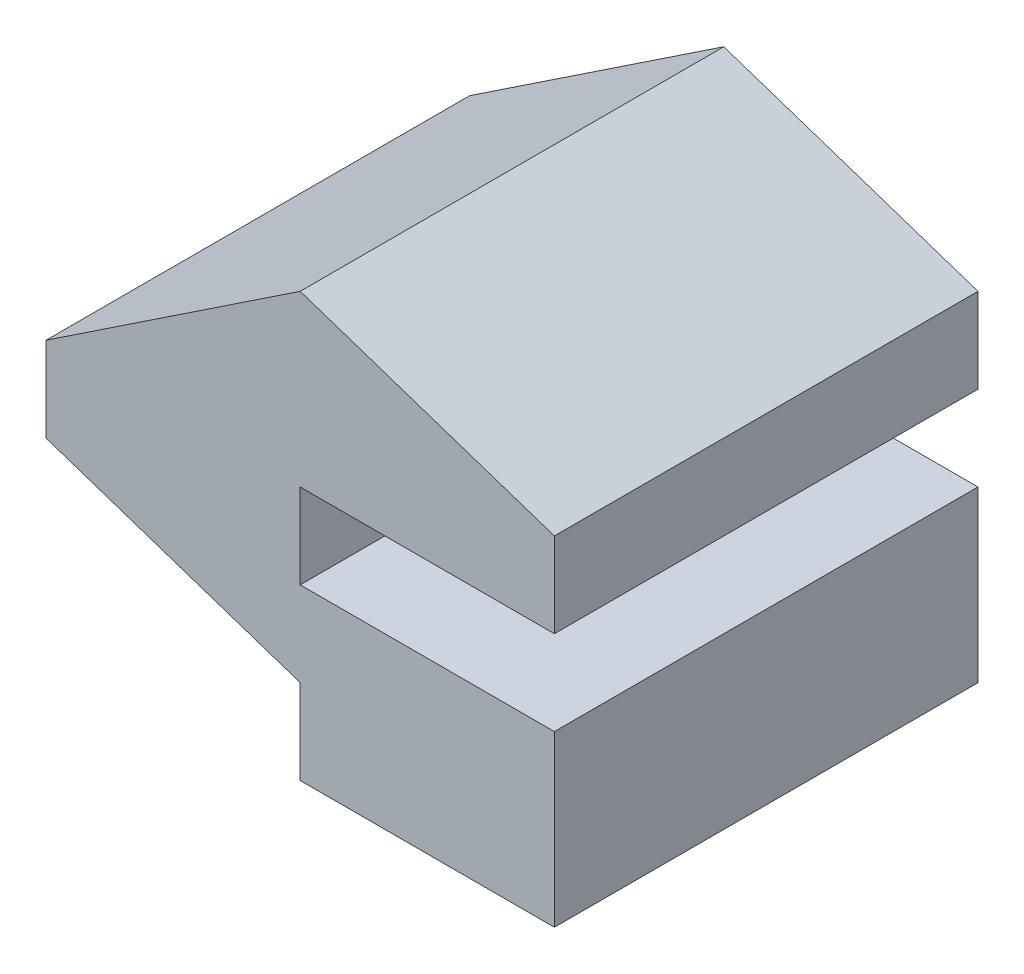
ISO-10303-21;
HEADER;
FILE_DESCRIPTION(('STEP AP214'),'2;1');
FILE_NAME('part.step','',(''),(''),'','','');
FILE_SCHEMA(('AUTOMOTIVE_DESIGN { 1 0 10303 214 1 1 1 1 }'));
ENDSEC;
DATA;
#1=APPLICATION_CONTEXT('core data for automotive mechanical design processes');
#2=APPLICATION_PROTOCOL_DEFINITION('international standard','automotive_design',2000,#1);
#3=PRODUCT_CONTEXT('',#1,'mechanical');
#4=PRODUCT('Part','Part','',(#3));
#5=PRODUCT_RELATED_PRODUCT_CATEGORY('part','',(#4));
#6=PRODUCT_DEFINITION_FORMATION('','',#4);
#7=PRODUCT_DEFINITION_CONTEXT('part definition',#1,'design');
#8=PRODUCT_DEFINITION('design','',#6,#7);
#9=PRODUCT_DEFINITION_SHAPE('','',#8);
#10=(LENGTH_UNIT() NAMED_UNIT(*) SI_UNIT(.MILLI.,.METRE.));
#11=(NAMED_UNIT(*) PLANE_ANGLE_UNIT() SI_UNIT($,.RADIAN.));
#12=(NAMED_UNIT(*) SI_UNIT($,.STERADIAN.) SOLID_ANGLE_UNIT());
#13=UNCERTAINTY_MEASURE_WITH_UNIT(LENGTH_MEASURE(1.E-05),#10,'distance_accuracy_value','');
#14=(GEOMETRIC_REPRESENTATION_CONTEXT(3) GLOBAL_UNCERTAINTY_ASSIGNED_CONTEXT((#13)) GLOBAL_UNIT_ASSIGNED_CONTEXT((#10,
#11,#12)) REPRESENTATION_CONTEXT('',''));
#15=CARTESIAN_POINT('',(0.,0.,0.));
#16=DIRECTION('',(0.,0.,1.));
#17=DIRECTION('',(1.,0.,0.));
#18=AXIS2_PLACEMENT_3D('',#15,#16,#17);
#19=CARTESIAN_POINT('',(3.,0.,5.));
#20=DIRECTION('',(0.,1.,0.));
#21=DIRECTION('',(-1.,0.,0.));
#22=AXIS2_PLACEMENT_3D('',#19,#20,#21);
#23=PLANE('',#22);
#24=DIRECTION('',(1.,0.,0.));
#25=VECTOR('',#24,1.);
#26=CARTESIAN_POINT('',(3.,0.,0.));
#27=LINE('',#26,#25);
#28=CARTESIAN_POINT('',(0.,0.,0.));
#29=VERTEX_POINT('',#28);
#30=CARTESIAN_POINT('',(3.,0.,0.));
#31=VERTEX_POINT('',#30);
#32=EDGE_CURVE('E147',#29,#31,#27,.T.);
#33=ORIENTED_EDGE('',*,*,#32,.T.);
#34=DIRECTION('',(0.,0.,-1.));
#35=VECTOR('',#34,1.);
#36=CARTESIAN_POINT('',(3.,0.,5.));
#37=LINE('',#36,#35);
#38=CARTESIAN_POINT('',(3.,0.,5.));
#39=VERTEX_POINT('',#38);
#40=EDGE_CURVE('E11',#39,#31,#37,.T.);
#41=ORIENTED_EDGE('',*,*,#40,.F.);
#42=DIRECTION('',(1.,0.,0.));
#43=VECTOR('',#42,1.);
#44=CARTESIAN_POINT('',(3.,0.,5.));
#45=LINE('',#44,#43);
#46=CARTESIAN_POINT('',(0.,0.,5.));
#47=VERTEX_POINT('',#46);
#48=EDGE_CURVE('E167',#47,#39,#45,.T.);
#49=ORIENTED_EDGE('',*,*,#48,.F.);
#50=DIRECTION('',(0.,0.,-1.));
#51=VECTOR('',#50,1.);
#52=CARTESIAN_POINT('',(0.,0.,5.));
#53=LINE('',#52,#51);
#54=EDGE_CURVE('E143',#47,#29,#53,.T.);
#55=ORIENTED_EDGE('',*,*,#54,.T.);
#56=EDGE_LOOP('',(#33,#41,#49,#55));
#57=FACE_BOUND('',#56,.T.);
#58=ADVANCED_FACE('F33',(#57),#23,.F.);
#59=CARTESIAN_POINT('',(3.,2.,5.));
#60=DIRECTION('',(-1.,0.,0.));
#61=DIRECTION('',(0.,-1.,0.));
#62=AXIS2_PLACEMENT_3D('',#59,#60,#61);
#63=PLANE('',#62);
#64=DIRECTION('',(0.,1.,0.));
#65=VECTOR('',#64,1.);
#66=CARTESIAN_POINT('',(3.,2.,0.));
#67=LINE('',#66,#65);
#68=CARTESIAN_POINT('',(3.,2.,0.));
#69=VERTEX_POINT('',#68);
#70=EDGE_CURVE('E150',#31,#69,#67,.T.);
#71=ORIENTED_EDGE('',*,*,#70,.T.);
#72=DIRECTION('',(0.,0.,-1.));
#73=VECTOR('',#72,1.);
#74=CARTESIAN_POINT('',(3.,2.,5.));
#75=LINE('',#74,#73);
#76=CARTESIAN_POINT('',(3.,2.,5.));
#77=VERTEX_POINT('',#76);
#78=EDGE_CURVE('E41',#77,#69,#75,.T.);
#79=ORIENTED_EDGE('',*,*,#78,.F.);
#80=DIRECTION('',(0.,1.,0.));
#81=VECTOR('',#80,1.);
#82=CARTESIAN_POINT('',(3.,2.,5.));
#83=LINE('',#82,#81);
#84=EDGE_CURVE('E101',#39,#77,#83,.T.);
#85=ORIENTED_EDGE('',*,*,#84,.F.);
#86=ORIENTED_EDGE('',*,*,#40,.T.);
#87=EDGE_LOOP('',(#71,#79,#85,#86));
#88=FACE_BOUND('',#87,.T.);
#89=ADVANCED_FACE('F239',(#88),#63,.F.);
#90=CARTESIAN_POINT('',(0.,2.,5.));
#91=DIRECTION('',(0.,-1.,0.));
#92=DIRECTION('',(1.,0.,0.));
#93=AXIS2_PLACEMENT_3D('',#90,#91,#92);
#94=PLANE('',#93);
#95=DIRECTION('',(-1.,0.,0.));
#96=VECTOR('',#95,1.);
#97=CARTESIAN_POINT('',(0.,2.,0.));
#98=LINE('',#97,#96);
#99=CARTESIAN_POINT('',(0.,2.,0.));
#100=VERTEX_POINT('',#99);
#101=EDGE_CURVE('E152',#69,#100,#98,.T.);
#102=ORIENTED_EDGE('',*,*,#101,.T.);
#103=DIRECTION('',(0.,0.,-1.));
#104=VECTOR('',#103,1.);
#105=CARTESIAN_POINT('',(0.,2.,5.));
#106=LINE('',#105,#104);
#107=CARTESIAN_POINT('',(0.,2.,5.));
#108=VERTEX_POINT('',#107);
#109=EDGE_CURVE('E183',#108,#100,#106,.T.);
#110=ORIENTED_EDGE('',*,*,#109,.F.);
#111=DIRECTION('',(-1.,0.,0.));
#112=VECTOR('',#111,1.);
#113=CARTESIAN_POINT('',(0.,2.,5.));
#114=LINE('',#113,#112);
#115=EDGE_CURVE('E191',#77,#108,#114,.T.);
#116=ORIENTED_EDGE('',*,*,#115,.F.);
#117=ORIENTED_EDGE('',*,*,#78,.T.);
#118=EDGE_LOOP('',(#102,#110,#116,#117));
#119=FACE_BOUND('',#118,.T.);
#120=ADVANCED_FACE('F189',(#119),#94,.F.);
#121=CARTESIAN_POINT('',(0.,3.,5.));
#122=DIRECTION('',(-1.,0.,0.));
#123=DIRECTION('',(0.,-1.,0.));
#124=AXIS2_PLACEMENT_3D('',#121,#122,#123);
#125=PLANE('',#124);
#126=DIRECTION('',(0.,1.,0.));
#127=VECTOR('',#126,1.);
#128=CARTESIAN_POINT('',(0.,3.,0.));
#129=LINE('',#128,#127);
#130=CARTESIAN_POINT('',(0.,3.,0.));
#131=VERTEX_POINT('',#130);
#132=EDGE_CURVE('E154',#100,#131,#129,.T.);
#133=ORIENTED_EDGE('',*,*,#132,.T.);
#134=DIRECTION('',(0.,0.,-1.));
#135=VECTOR('',#134,1.);
#136=CARTESIAN_POINT('',(0.,3.,5.));
#137=LINE('',#136,#135);
#138=CARTESIAN_POINT('',(0.,3.,5.));
#139=VERTEX_POINT('',#138);
#140=EDGE_CURVE('E180',#139,#131,#137,.T.);
#141=ORIENTED_EDGE('',*,*,#140,.F.);
#142=DIRECTION('',(0.,1.,0.));
#143=VECTOR('',#142,1.);
#144=CARTESIAN_POINT('',(0.,3.,5.));
#145=LINE('',#144,#143);
#146=EDGE_CURVE('E209',#108,#139,#145,.T.);
#147=ORIENTED_EDGE('',*,*,#146,.F.);
#148=ORIENTED_EDGE('',*,*,#109,.T.);
#149=EDGE_LOOP('',(#133,#141,#147,#148));
#150=FACE_BOUND('',#149,.T.);
#151=ADVANCED_FACE('F200',(#150),#125,.F.);
#152=CARTESIAN_POINT('',(3.,3.,5.));
#153=DIRECTION('',(0.,1.,0.));
#154=DIRECTION('',(-1.,0.,0.));
#155=AXIS2_PLACEMENT_3D('',#152,#153,#154);
#156=PLANE('',#155);
#157=DIRECTION('',(1.,0.,0.));
#158=VECTOR('',#157,1.);
#159=CARTESIAN_POINT('',(3.,3.,0.));
#160=LINE('',#159,#158);
#161=CARTESIAN_POINT('',(3.,3.,0.));
#162=VERTEX_POINT('',#161);
#163=EDGE_CURVE('E156',#131,#162,#160,.T.);
#164=ORIENTED_EDGE('',*,*,#163,.T.);
#165=DIRECTION('',(0.,0.,-1.));
#166=VECTOR('',#165,1.);
#167=CARTESIAN_POINT('',(3.,3.,5.));
#168=LINE('',#167,#166);
#169=CARTESIAN_POINT('',(3.,3.,5.));
#170=VERTEX_POINT('',#169);
#171=EDGE_CURVE('E177',#170,#162,#168,.T.);
#172=ORIENTED_EDGE('',*,*,#171,.F.);
#173=DIRECTION('',(1.,0.,0.));
#174=VECTOR('',#173,1.);
#175=CARTESIAN_POINT('',(3.,3.,5.));
#176=LINE('',#175,#174);
#177=EDGE_CURVE('E206',#139,#170,#176,.T.);
#178=ORIENTED_EDGE('',*,*,#177,.F.);
#179=ORIENTED_EDGE('',*,*,#140,.T.);
#180=EDGE_LOOP('',(#164,#172,#178,#179));
#181=FACE_BOUND('',#180,.T.);
#182=ADVANCED_FACE('F204',(#181),#156,.F.);
#183=CARTESIAN_POINT('',(3.,4.,5.));
#184=DIRECTION('',(-1.,0.,0.));
#185=DIRECTION('',(0.,0.,1.));
#186=AXIS2_PLACEMENT_3D('',#183,#184,#185);
#187=PLANE('',#186);
#188=DIRECTION('',(0.,1.,0.));
#189=VECTOR('',#188,1.);
#190=CARTESIAN_POINT('',(3.,4.,0.));
#191=LINE('',#190,#189);
#192=CARTESIAN_POINT('',(3.,4.,0.));
#193=VERTEX_POINT('',#192);
#194=EDGE_CURVE('E158',#162,#193,#191,.T.);
#195=ORIENTED_EDGE('',*,*,#194,.T.);
#196=DIRECTION('',(0.,0.,-1.));
#197=VECTOR('',#196,1.);
#198=CARTESIAN_POINT('',(3.,4.,5.));
#199=LINE('',#198,#197);
#200=CARTESIAN_POINT('',(3.,4.,5.));
#201=VERTEX_POINT('',#200);
#202=EDGE_CURVE('E174',#201,#193,#199,.T.);
#203=ORIENTED_EDGE('',*,*,#202,.F.);
#204=DIRECTION('',(0.,1.,0.));
#205=VECTOR('',#204,1.);
#206=CARTESIAN_POINT('',(3.,4.,5.));
#207=LINE('',#206,#205);
#208=EDGE_CURVE('E208',#170,#201,#207,.T.);
#209=ORIENTED_EDGE('',*,*,#208,.F.);
#210=ORIENTED_EDGE('',*,*,#171,.T.);
#211=EDGE_LOOP('',(#195,#203,#209,#210));
#212=FACE_BOUND('',#211,.T.);
#213=ADVANCED_FACE('F252',(#212),#187,.F.);
#214=CARTESIAN_POINT('',(0.,5.,5.));
#215=DIRECTION('',(-0.316227766016838,-0.948683298050514,0.));
#216=DIRECTION('',(0.948683298050514,-0.316227766016838,0.));
#217=AXIS2_PLACEMENT_3D('',#214,#215,#216);
#218=PLANE('',#217);
#219=DIRECTION('',(-0.948683298050514,0.316227766016838,0.));
#220=VECTOR('',#219,1.);
#221=CARTESIAN_POINT('',(0.,5.,0.));
#222=LINE('',#221,#220);
#223=CARTESIAN_POINT('',(0.,5.,0.));
#224=VERTEX_POINT('',#223);
#225=EDGE_CURVE('E160',#193,#224,#222,.T.);
#226=ORIENTED_EDGE('',*,*,#225,.T.);
#227=DIRECTION('',(0.,0.,-1.));
#228=VECTOR('',#227,1.);
#229=CARTESIAN_POINT('',(0.,5.,5.));
#230=LINE('',#229,#228);
#231=CARTESIAN_POINT('',(0.,5.,5.));
#232=VERTEX_POINT('',#231);
#233=EDGE_CURVE('E171',#232,#224,#230,.T.);
#234=ORIENTED_EDGE('',*,*,#233,.F.);
#235=DIRECTION('',(-0.948683298050514,0.316227766016838,0.));
#236=VECTOR('',#235,1.);
#237=CARTESIAN_POINT('',(0.,5.,5.));
#238=LINE('',#237,#236);
#239=EDGE_CURVE('E211',#201,#232,#238,.T.);
#240=ORIENTED_EDGE('',*,*,#239,.F.);
#241=ORIENTED_EDGE('',*,*,#202,.T.);
#242=EDGE_LOOP('',(#226,#234,#240,#241));
#243=FACE_BOUND('',#242,.T.);
#244=ADVANCED_FACE('F220',(#243),#218,.F.);
#245=CARTESIAN_POINT('',(-3.,3.,5.));
#246=DIRECTION('',(0.554700196225229,-0.832050294337844,0.));
#247=DIRECTION('',(0.832050294337844,0.554700196225229,0.));
#248=AXIS2_PLACEMENT_3D('',#245,#246,#247);
#249=PLANE('',#248);
#250=DIRECTION('',(-0.832050294337844,-0.554700196225229,0.));
#251=VECTOR('',#250,1.);
#252=CARTESIAN_POINT('',(-3.,3.,0.));
#253=LINE('',#252,#251);
#254=CARTESIAN_POINT('',(-3.,3.,0.));
#255=VERTEX_POINT('',#254);
#256=EDGE_CURVE('E162',#224,#255,#253,.T.);
#257=ORIENTED_EDGE('',*,*,#256,.T.);
#258=DIRECTION('',(0.,0.,-1.));
#259=VECTOR('',#258,1.);
#260=CARTESIAN_POINT('',(-3.,3.,5.));
#261=LINE('',#260,#259);
#262=CARTESIAN_POINT('',(-3.,3.,5.));
#263=VERTEX_POINT('',#262);
#264=EDGE_CURVE('E138',#263,#255,#261,.T.);
#265=ORIENTED_EDGE('',*,*,#264,.F.);
#266=DIRECTION('',(-0.832050294337844,-0.554700196225229,0.));
#267=VECTOR('',#266,1.);
#268=CARTESIAN_POINT('',(-3.,3.,5.));
#269=LINE('',#268,#267);
#270=EDGE_CURVE('E129',#232,#263,#269,.T.);
#271=ORIENTED_EDGE('',*,*,#270,.F.);
#272=ORIENTED_EDGE('',*,*,#233,.T.);
#273=EDGE_LOOP('',(#257,#265,#271,#272));
#274=FACE_BOUND('',#273,.T.);
#275=ADVANCED_FACE('F224',(#274),#249,.F.);
#276=CARTESIAN_POINT('',(-3.,2.,5.));
#277=DIRECTION('',(1.,0.,0.));
#278=DIRECTION('',(0.,0.,-1.));
#279=AXIS2_PLACEMENT_3D('',#276,#277,#278);
#280=PLANE('',#279);
#281=DIRECTION('',(0.,-1.,0.));
#282=VECTOR('',#281,1.);
#283=CARTESIAN_POINT('',(-3.,2.,0.));
#284=LINE('',#283,#282);
#285=CARTESIAN_POINT('',(-3.,2.,0.));
#286=VERTEX_POINT('',#285);
#287=EDGE_CURVE('E137',#255,#286,#284,.T.);
#288=ORIENTED_EDGE('',*,*,#287,.T.);
#289=DIRECTION('',(0.,0.,-1.));
#290=VECTOR('',#289,1.);
#291=CARTESIAN_POINT('',(-3.,2.,5.));
#292=LINE('',#291,#290);
#293=CARTESIAN_POINT('',(-3.,2.,5.));
#294=VERTEX_POINT('',#293);
#295=EDGE_CURVE('E134',#294,#286,#292,.T.);
#296=ORIENTED_EDGE('',*,*,#295,.F.);
#297=DIRECTION('',(0.,-1.,0.));
#298=VECTOR('',#297,1.);
#299=CARTESIAN_POINT('',(-3.,2.,5.));
#300=LINE('',#299,#298);
#301=EDGE_CURVE('E123',#263,#294,#300,.T.);
#302=ORIENTED_EDGE('',*,*,#301,.F.);
#303=ORIENTED_EDGE('',*,*,#264,.T.);
#304=EDGE_LOOP('',(#288,#296,#302,#303));
#305=FACE_BOUND('',#304,.T.);
#306=ADVANCED_FACE('F135',(#305),#280,.F.);
#307=CARTESIAN_POINT('',(0.,1.,5.));
#308=DIRECTION('',(0.316227766016838,0.948683298050514,0.));
#309=DIRECTION('',(-0.948683298050514,0.316227766016838,0.));
#310=AXIS2_PLACEMENT_3D('',#307,#308,#309);
#311=PLANE('',#310);
#312=DIRECTION('',(0.948683298050514,-0.316227766016838,0.));
#313=VECTOR('',#312,1.);
#314=CARTESIAN_POINT('',(0.,1.,0.));
#315=LINE('',#314,#313);
#316=CARTESIAN_POINT('',(0.,1.,0.));
#317=VERTEX_POINT('',#316);
#318=EDGE_CURVE('E87',#286,#317,#315,.T.);
#319=ORIENTED_EDGE('',*,*,#318,.T.);
#320=DIRECTION('',(0.,0.,-1.));
#321=VECTOR('',#320,1.);
#322=CARTESIAN_POINT('',(0.,1.,5.));
#323=LINE('',#322,#321);
#324=CARTESIAN_POINT('',(0.,1.,5.));
#325=VERTEX_POINT('',#324);
#326=EDGE_CURVE('E139',#325,#317,#323,.T.);
#327=ORIENTED_EDGE('',*,*,#326,.F.);
#328=DIRECTION('',(0.948683298050514,-0.316227766016838,0.));
#329=VECTOR('',#328,1.);
#330=CARTESIAN_POINT('',(0.,1.,5.));
#331=LINE('',#330,#329);
#332=EDGE_CURVE('E127',#294,#325,#331,.T.);
#333=ORIENTED_EDGE('',*,*,#332,.F.);
#334=ORIENTED_EDGE('',*,*,#295,.T.);
#335=EDGE_LOOP('',(#319,#327,#333,#334));
#336=FACE_BOUND('',#335,.T.);
#337=ADVANCED_FACE('F141',(#336),#311,.F.);
#338=CARTESIAN_POINT('',(0.,0.,5.));
#339=DIRECTION('',(1.,0.,0.));
#340=DIRECTION('',(0.,0.,-1.));
#341=AXIS2_PLACEMENT_3D('',#338,#339,#340);
#342=PLANE('',#341);
#343=DIRECTION('',(0.,-1.,0.));
#344=VECTOR('',#343,1.);
#345=CARTESIAN_POINT('',(0.,0.,0.));
#346=LINE('',#345,#344);
#347=EDGE_CURVE('E93',#317,#29,#346,.T.);
#348=ORIENTED_EDGE('',*,*,#347,.T.);
#349=ORIENTED_EDGE('',*,*,#54,.F.);
#350=DIRECTION('',(0.,-1.,0.));
#351=VECTOR('',#350,1.);
#352=CARTESIAN_POINT('',(0.,0.,5.));
#353=LINE('',#352,#351);
#354=EDGE_CURVE('E49',#325,#47,#353,.T.);
#355=ORIENTED_EDGE('',*,*,#354,.F.);
#356=ORIENTED_EDGE('',*,*,#326,.T.);
#357=EDGE_LOOP('',(#348,#349,#355,#356));
#358=FACE_BOUND('',#357,.T.);
#359=ADVANCED_FACE('F228',(#358),#342,.F.);
#360=CARTESIAN_POINT('',(0.,0.,5.));
#361=DIRECTION('',(0.,0.,-1.));
#362=DIRECTION('',(-1.,0.,0.));
#363=AXIS2_PLACEMENT_3D('',#360,#361,#362);
#364=PLANE('',#363);
#365=ORIENTED_EDGE('',*,*,#48,.T.);
#366=ORIENTED_EDGE('',*,*,#84,.T.);
#367=ORIENTED_EDGE('',*,*,#115,.T.);
#368=ORIENTED_EDGE('',*,*,#146,.T.);
#369=ORIENTED_EDGE('',*,*,#177,.T.);
#370=ORIENTED_EDGE('',*,*,#208,.T.);
#371=ORIENTED_EDGE('',*,*,#239,.T.);
#372=ORIENTED_EDGE('',*,*,#270,.T.);
#373=ORIENTED_EDGE('',*,*,#301,.T.);
#374=ORIENTED_EDGE('',*,*,#332,.T.);
#375=ORIENTED_EDGE('',*,*,#354,.T.);
#376=EDGE_LOOP('',(#365,#366,#367,#368,#369,#370,#371,#372,#373,#374,#375));
#377=FACE_BOUND('',#376,.T.);
#378=ADVANCED_FACE('F125',(#377),#364,.F.);
#379=CARTESIAN_POINT('',(0.,0.,0.));
#380=DIRECTION('',(0.,0.,-1.));
#381=DIRECTION('',(-1.,0.,0.));
#382=AXIS2_PLACEMENT_3D('',#379,#380,#381);
#383=PLANE('',#382);
#384=ORIENTED_EDGE('',*,*,#32,.F.);
#385=ORIENTED_EDGE('',*,*,#347,.F.);
#386=ORIENTED_EDGE('',*,*,#318,.F.);
#387=ORIENTED_EDGE('',*,*,#287,.F.);
#388=ORIENTED_EDGE('',*,*,#256,.F.);
#389=ORIENTED_EDGE('',*,*,#225,.F.);
#390=ORIENTED_EDGE('',*,*,#194,.F.);
#391=ORIENTED_EDGE('',*,*,#163,.F.);
#392=ORIENTED_EDGE('',*,*,#132,.F.);
#393=ORIENTED_EDGE('',*,*,#101,.F.);
#394=ORIENTED_EDGE('',*,*,#70,.F.);
#395=EDGE_LOOP('',(#384,#385,#386,#387,#388,#389,#390,#391,#392,#393,#394));
#396=FACE_BOUND('',#395,.T.);
#397=ADVANCED_FACE('F195',(#396),#383,.T.);
#398=CLOSED_SHELL('',(#58,#89,#120,#151,#182,#213,#244,#275,#306,#337,#359,#378,#397));
#399=MANIFOLD_SOLID_BREP('B2',#398);
#400=ADVANCED_BREP_SHAPE_REPRESENTATION('',(#18,#399),#14);
#401=SHAPE_DEFINITION_REPRESENTATION(#9,#400);
ENDSEC;
END-ISO-10303-21;
